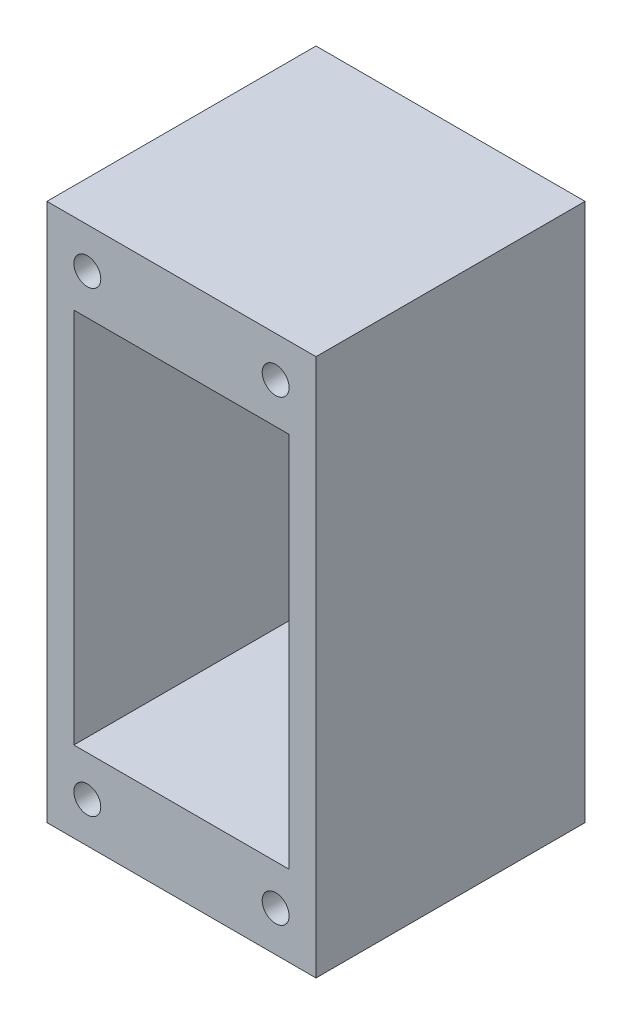
ISO-10303-21;
HEADER;
FILE_DESCRIPTION(('STEP AP214'),'2;1');
FILE_NAME('part.step','',(''),(''),'','','');
FILE_SCHEMA(('AUTOMOTIVE_DESIGN { 1 0 10303 214 1 1 1 1 }'));
ENDSEC;
DATA;
#1=APPLICATION_CONTEXT('core data for automotive mechanical design processes');
#2=APPLICATION_PROTOCOL_DEFINITION('international standard','automotive_design',2000,#1);
#3=PRODUCT_CONTEXT('',#1,'mechanical');
#4=PRODUCT('Part','Part','',(#3));
#5=PRODUCT_RELATED_PRODUCT_CATEGORY('part','',(#4));
#6=PRODUCT_DEFINITION_FORMATION('','',#4);
#7=PRODUCT_DEFINITION_CONTEXT('part definition',#1,'design');
#8=PRODUCT_DEFINITION('design','',#6,#7);
#9=PRODUCT_DEFINITION_SHAPE('','',#8);
#10=(LENGTH_UNIT() NAMED_UNIT(*) SI_UNIT(.MILLI.,.METRE.));
#11=(NAMED_UNIT(*) PLANE_ANGLE_UNIT() SI_UNIT($,.RADIAN.));
#12=(NAMED_UNIT(*) SI_UNIT($,.STERADIAN.) SOLID_ANGLE_UNIT());
#13=UNCERTAINTY_MEASURE_WITH_UNIT(LENGTH_MEASURE(1.E-05),#10,'distance_accuracy_value','');
#14=(GEOMETRIC_REPRESENTATION_CONTEXT(3) GLOBAL_UNCERTAINTY_ASSIGNED_CONTEXT((#13)) GLOBAL_UNIT_ASSIGNED_CONTEXT((#10,
#11,#12)) REPRESENTATION_CONTEXT('',''));
#15=CARTESIAN_POINT('',(0.,0.,0.));
#16=DIRECTION('',(0.,0.,1.));
#17=DIRECTION('',(1.,0.,0.));
#18=AXIS2_PLACEMENT_3D('',#15,#16,#17);
#19=CARTESIAN_POINT('',(0.,0.,50.));
#20=DIRECTION('',(0.,0.,1.));
#21=DIRECTION('',(1.,0.,0.));
#22=AXIS2_PLACEMENT_3D('',#19,#20,#21);
#23=PLANE('',#22);
#24=DIRECTION('',(0.,-1.,0.));
#25=VECTOR('',#24,1.);
#26=CARTESIAN_POINT('',(-20.,-35.,50.));
#27=LINE('',#26,#25);
#28=CARTESIAN_POINT('',(-20.,35.,50.));
#29=VERTEX_POINT('',#28);
#30=CARTESIAN_POINT('',(-20.,-35.,50.));
#31=VERTEX_POINT('',#30);
#32=EDGE_CURVE('E58',#29,#31,#27,.T.);
#33=ORIENTED_EDGE('',*,*,#32,.F.);
#34=DIRECTION('',(-1.,0.,0.));
#35=VECTOR('',#34,1.);
#36=CARTESIAN_POINT('',(-20.,35.,50.));
#37=LINE('',#36,#35);
#38=CARTESIAN_POINT('',(20.,35.,50.));
#39=VERTEX_POINT('',#38);
#40=EDGE_CURVE('E128',#39,#29,#37,.T.);
#41=ORIENTED_EDGE('',*,*,#40,.F.);
#42=DIRECTION('',(0.,1.,0.));
#43=VECTOR('',#42,1.);
#44=CARTESIAN_POINT('',(20.,35.,50.));
#45=LINE('',#44,#43);
#46=CARTESIAN_POINT('',(20.,-35.,50.));
#47=VERTEX_POINT('',#46);
#48=EDGE_CURVE('E111',#47,#39,#45,.T.);
#49=ORIENTED_EDGE('',*,*,#48,.F.);
#50=DIRECTION('',(1.,0.,0.));
#51=VECTOR('',#50,1.);
#52=CARTESIAN_POINT('',(20.,-35.,50.));
#53=LINE('',#52,#51);
#54=EDGE_CURVE('E121',#31,#47,#53,.T.);
#55=ORIENTED_EDGE('',*,*,#54,.F.);
#56=EDGE_LOOP('',(#33,#41,#49,#55));
#57=FACE_BOUND('',#56,.T.);
#58=CARTESIAN_POINT('',(-17.5,-42.5,50.));
#59=DIRECTION('',(0.,0.,1.));
#60=DIRECTION('',(1.,0.,0.));
#61=AXIS2_PLACEMENT_3D('',#58,#59,#60);
#62=CIRCLE('',#61,2.5);
#63=CARTESIAN_POINT('',(-15.,-42.5,50.));
#64=VERTEX_POINT('',#63);
#65=EDGE_CURVE('E151',#64,#64,#62,.T.);
#66=ORIENTED_EDGE('',*,*,#65,.F.);
#67=EDGE_LOOP('',(#66));
#68=FACE_BOUND('',#67,.T.);
#69=CARTESIAN_POINT('',(-17.5,42.5,50.));
#70=DIRECTION('',(0.,0.,1.));
#71=DIRECTION('',(1.,0.,0.));
#72=AXIS2_PLACEMENT_3D('',#69,#70,#71);
#73=CIRCLE('',#72,2.5);
#74=CARTESIAN_POINT('',(-15.,42.5,50.));
#75=VERTEX_POINT('',#74);
#76=EDGE_CURVE('E167',#75,#75,#73,.T.);
#77=ORIENTED_EDGE('',*,*,#76,.F.);
#78=EDGE_LOOP('',(#77));
#79=FACE_BOUND('',#78,.T.);
#80=DIRECTION('',(0.,1.,0.));
#81=VECTOR('',#80,1.);
#82=CARTESIAN_POINT('',(25.,50.,50.));
#83=LINE('',#82,#81);
#84=CARTESIAN_POINT('',(25.,-50.,50.));
#85=VERTEX_POINT('',#84);
#86=CARTESIAN_POINT('',(25.,50.,50.));
#87=VERTEX_POINT('',#86);
#88=EDGE_CURVE('E175',#85,#87,#83,.T.);
#89=ORIENTED_EDGE('',*,*,#88,.T.);
#90=DIRECTION('',(-1.,0.,0.));
#91=VECTOR('',#90,1.);
#92=CARTESIAN_POINT('',(-25.,50.,50.));
#93=LINE('',#92,#91);
#94=CARTESIAN_POINT('',(-25.,50.,50.));
#95=VERTEX_POINT('',#94);
#96=EDGE_CURVE('E179',#87,#95,#93,.T.);
#97=ORIENTED_EDGE('',*,*,#96,.T.);
#98=DIRECTION('',(0.,-1.,0.));
#99=VECTOR('',#98,1.);
#100=CARTESIAN_POINT('',(-25.,50.,50.));
#101=LINE('',#100,#99);
#102=CARTESIAN_POINT('',(-25.,-50.,50.));
#103=VERTEX_POINT('',#102);
#104=EDGE_CURVE('E183',#95,#103,#101,.T.);
#105=ORIENTED_EDGE('',*,*,#104,.T.);
#106=DIRECTION('',(1.,0.,0.));
#107=VECTOR('',#106,1.);
#108=CARTESIAN_POINT('',(-25.,-50.,50.));
#109=LINE('',#108,#107);
#110=EDGE_CURVE('E186',#103,#85,#109,.T.);
#111=ORIENTED_EDGE('',*,*,#110,.T.);
#112=EDGE_LOOP('',(#89,#97,#105,#111));
#113=FACE_BOUND('',#112,.T.);
#114=CARTESIAN_POINT('',(17.5,42.5,50.));
#115=DIRECTION('',(0.,0.,1.));
#116=DIRECTION('',(1.,0.,0.));
#117=AXIS2_PLACEMENT_3D('',#114,#115,#116);
#118=CIRCLE('',#117,2.5);
#119=CARTESIAN_POINT('',(20.,42.5,50.));
#120=VERTEX_POINT('',#119);
#121=EDGE_CURVE('E159',#120,#120,#118,.T.);
#122=ORIENTED_EDGE('',*,*,#121,.F.);
#123=EDGE_LOOP('',(#122));
#124=FACE_BOUND('',#123,.T.);
#125=CARTESIAN_POINT('',(17.5,-42.5,50.));
#126=DIRECTION('',(0.,0.,1.));
#127=DIRECTION('',(1.,0.,0.));
#128=AXIS2_PLACEMENT_3D('',#125,#126,#127);
#129=CIRCLE('',#128,2.5);
#130=CARTESIAN_POINT('',(20.,-42.5,50.));
#131=VERTEX_POINT('',#130);
#132=EDGE_CURVE('E143',#131,#131,#129,.T.);
#133=ORIENTED_EDGE('',*,*,#132,.F.);
#134=EDGE_LOOP('',(#133));
#135=FACE_BOUND('',#134,.T.);
#136=ADVANCED_FACE('F42',(#57,#68,#79,#113,#124,#135),#23,.T.);
#137=CARTESIAN_POINT('',(0.,0.,0.));
#138=DIRECTION('',(0.,0.,1.));
#139=DIRECTION('',(1.,0.,0.));
#140=AXIS2_PLACEMENT_3D('',#137,#138,#139);
#141=PLANE('',#140);
#142=DIRECTION('',(-1.,0.,0.));
#143=VECTOR('',#142,1.);
#144=CARTESIAN_POINT('',(0.,35.,0.));
#145=LINE('',#144,#143);
#146=CARTESIAN_POINT('',(20.,35.,0.));
#147=VERTEX_POINT('',#146);
#148=CARTESIAN_POINT('',(-20.,35.,0.));
#149=VERTEX_POINT('',#148);
#150=EDGE_CURVE('E51',#147,#149,#145,.T.);
#151=ORIENTED_EDGE('',*,*,#150,.T.);
#152=DIRECTION('',(0.,-1.,0.));
#153=VECTOR('',#152,1.);
#154=CARTESIAN_POINT('',(-20.,0.,0.));
#155=LINE('',#154,#153);
#156=CARTESIAN_POINT('',(-20.,-35.,0.));
#157=VERTEX_POINT('',#156);
#158=EDGE_CURVE('E11',#149,#157,#155,.T.);
#159=ORIENTED_EDGE('',*,*,#158,.T.);
#160=DIRECTION('',(1.,0.,0.));
#161=VECTOR('',#160,1.);
#162=CARTESIAN_POINT('',(0.,-35.,0.));
#163=LINE('',#162,#161);
#164=CARTESIAN_POINT('',(20.,-35.,0.));
#165=VERTEX_POINT('',#164);
#166=EDGE_CURVE('E216',#157,#165,#163,.T.);
#167=ORIENTED_EDGE('',*,*,#166,.T.);
#168=DIRECTION('',(0.,1.,0.));
#169=VECTOR('',#168,1.);
#170=CARTESIAN_POINT('',(20.,0.,0.));
#171=LINE('',#170,#169);
#172=EDGE_CURVE('E114',#165,#147,#171,.T.);
#173=ORIENTED_EDGE('',*,*,#172,.T.);
#174=EDGE_LOOP('',(#151,#159,#167,#173));
#175=FACE_BOUND('',#174,.T.);
#176=DIRECTION('',(0.,1.,0.));
#177=VECTOR('',#176,1.);
#178=CARTESIAN_POINT('',(25.,50.,0.));
#179=LINE('',#178,#177);
#180=CARTESIAN_POINT('',(25.,-50.,0.));
#181=VERTEX_POINT('',#180);
#182=CARTESIAN_POINT('',(25.,50.,0.));
#183=VERTEX_POINT('',#182);
#184=EDGE_CURVE('E171',#181,#183,#179,.T.);
#185=ORIENTED_EDGE('',*,*,#184,.F.);
#186=DIRECTION('',(1.,0.,0.));
#187=VECTOR('',#186,1.);
#188=CARTESIAN_POINT('',(-25.,-50.,0.));
#189=LINE('',#188,#187);
#190=CARTESIAN_POINT('',(-25.,-50.,0.));
#191=VERTEX_POINT('',#190);
#192=EDGE_CURVE('E180',#191,#181,#189,.T.);
#193=ORIENTED_EDGE('',*,*,#192,.F.);
#194=DIRECTION('',(0.,-1.,0.));
#195=VECTOR('',#194,1.);
#196=CARTESIAN_POINT('',(-25.,50.,0.));
#197=LINE('',#196,#195);
#198=CARTESIAN_POINT('',(-25.,50.,0.));
#199=VERTEX_POINT('',#198);
#200=EDGE_CURVE('E196',#199,#191,#197,.T.);
#201=ORIENTED_EDGE('',*,*,#200,.F.);
#202=DIRECTION('',(-1.,0.,0.));
#203=VECTOR('',#202,1.);
#204=CARTESIAN_POINT('',(-25.,50.,0.));
#205=LINE('',#204,#203);
#206=EDGE_CURVE('E193',#183,#199,#205,.T.);
#207=ORIENTED_EDGE('',*,*,#206,.F.);
#208=EDGE_LOOP('',(#185,#193,#201,#207));
#209=FACE_BOUND('',#208,.T.);
#210=CARTESIAN_POINT('',(-17.5,42.5,0.));
#211=DIRECTION('',(0.,0.,1.));
#212=DIRECTION('',(1.,0.,0.));
#213=AXIS2_PLACEMENT_3D('',#210,#211,#212);
#214=CIRCLE('',#213,2.5);
#215=CARTESIAN_POINT('',(-15.,42.5,0.));
#216=VERTEX_POINT('',#215);
#217=EDGE_CURVE('E163',#216,#216,#214,.T.);
#218=ORIENTED_EDGE('',*,*,#217,.T.);
#219=EDGE_LOOP('',(#218));
#220=FACE_BOUND('',#219,.T.);
#221=CARTESIAN_POINT('',(17.5,42.5,0.));
#222=DIRECTION('',(0.,0.,1.));
#223=DIRECTION('',(1.,0.,0.));
#224=AXIS2_PLACEMENT_3D('',#221,#222,#223);
#225=CIRCLE('',#224,2.5);
#226=CARTESIAN_POINT('',(20.,42.5,0.));
#227=VERTEX_POINT('',#226);
#228=EDGE_CURVE('E155',#227,#227,#225,.T.);
#229=ORIENTED_EDGE('',*,*,#228,.T.);
#230=EDGE_LOOP('',(#229));
#231=FACE_BOUND('',#230,.T.);
#232=CARTESIAN_POINT('',(-17.5,-42.5,0.));
#233=DIRECTION('',(0.,0.,1.));
#234=DIRECTION('',(1.,0.,0.));
#235=AXIS2_PLACEMENT_3D('',#232,#233,#234);
#236=CIRCLE('',#235,2.5);
#237=CARTESIAN_POINT('',(-15.,-42.5,0.));
#238=VERTEX_POINT('',#237);
#239=EDGE_CURVE('E147',#238,#238,#236,.T.);
#240=ORIENTED_EDGE('',*,*,#239,.T.);
#241=EDGE_LOOP('',(#240));
#242=FACE_BOUND('',#241,.T.);
#243=CARTESIAN_POINT('',(17.5,-42.5,0.));
#244=DIRECTION('',(0.,0.,1.));
#245=DIRECTION('',(1.,0.,0.));
#246=AXIS2_PLACEMENT_3D('',#243,#244,#245);
#247=CIRCLE('',#246,2.5);
#248=CARTESIAN_POINT('',(20.,-42.5,0.));
#249=VERTEX_POINT('',#248);
#250=EDGE_CURVE('E138',#249,#249,#247,.T.);
#251=ORIENTED_EDGE('',*,*,#250,.T.);
#252=EDGE_LOOP('',(#251));
#253=FACE_BOUND('',#252,.T.);
#254=ADVANCED_FACE('F223',(#175,#209,#220,#231,#242,#253),#141,.F.);
#255=CARTESIAN_POINT('',(25.,50.,50.));
#256=DIRECTION('',(-1.,0.,0.));
#257=DIRECTION('',(0.,-1.,0.));
#258=AXIS2_PLACEMENT_3D('',#255,#256,#257);
#259=PLANE('',#258);
#260=ORIENTED_EDGE('',*,*,#184,.T.);
#261=DIRECTION('',(0.,0.,-1.));
#262=VECTOR('',#261,1.);
#263=CARTESIAN_POINT('',(25.,50.,50.));
#264=LINE('',#263,#262);
#265=EDGE_CURVE('E212',#87,#183,#264,.T.);
#266=ORIENTED_EDGE('',*,*,#265,.F.);
#267=ORIENTED_EDGE('',*,*,#88,.F.);
#268=DIRECTION('',(0.,0.,-1.));
#269=VECTOR('',#268,1.);
#270=CARTESIAN_POINT('',(25.,-50.,50.));
#271=LINE('',#270,#269);
#272=EDGE_CURVE('E189',#85,#181,#271,.T.);
#273=ORIENTED_EDGE('',*,*,#272,.T.);
#274=EDGE_LOOP('',(#260,#266,#267,#273));
#275=FACE_BOUND('',#274,.T.);
#276=ADVANCED_FACE('F44',(#275),#259,.F.);
#277=CARTESIAN_POINT('',(-25.,50.,50.));
#278=DIRECTION('',(0.,-1.,0.));
#279=DIRECTION('',(0.,0.,-1.));
#280=AXIS2_PLACEMENT_3D('',#277,#278,#279);
#281=PLANE('',#280);
#282=ORIENTED_EDGE('',*,*,#206,.T.);
#283=DIRECTION('',(0.,0.,-1.));
#284=VECTOR('',#283,1.);
#285=CARTESIAN_POINT('',(-25.,50.,50.));
#286=LINE('',#285,#284);
#287=EDGE_CURVE('E208',#95,#199,#286,.T.);
#288=ORIENTED_EDGE('',*,*,#287,.F.);
#289=ORIENTED_EDGE('',*,*,#96,.F.);
#290=ORIENTED_EDGE('',*,*,#265,.T.);
#291=EDGE_LOOP('',(#282,#288,#289,#290));
#292=FACE_BOUND('',#291,.T.);
#293=ADVANCED_FACE('F258',(#292),#281,.F.);
#294=CARTESIAN_POINT('',(-25.,50.,50.));
#295=DIRECTION('',(1.,0.,0.));
#296=DIRECTION('',(0.,1.,0.));
#297=AXIS2_PLACEMENT_3D('',#294,#295,#296);
#298=PLANE('',#297);
#299=ORIENTED_EDGE('',*,*,#200,.T.);
#300=DIRECTION('',(0.,0.,-1.));
#301=VECTOR('',#300,1.);
#302=CARTESIAN_POINT('',(-25.,-50.,50.));
#303=LINE('',#302,#301);
#304=EDGE_CURVE('E204',#103,#191,#303,.T.);
#305=ORIENTED_EDGE('',*,*,#304,.F.);
#306=ORIENTED_EDGE('',*,*,#104,.F.);
#307=ORIENTED_EDGE('',*,*,#287,.T.);
#308=EDGE_LOOP('',(#299,#305,#306,#307));
#309=FACE_BOUND('',#308,.T.);
#310=ADVANCED_FACE('F255',(#309),#298,.F.);
#311=CARTESIAN_POINT('',(-25.,-50.,50.));
#312=DIRECTION('',(0.,1.,0.));
#313=DIRECTION('',(0.,0.,1.));
#314=AXIS2_PLACEMENT_3D('',#311,#312,#313);
#315=PLANE('',#314);
#316=ORIENTED_EDGE('',*,*,#192,.T.);
#317=ORIENTED_EDGE('',*,*,#272,.F.);
#318=ORIENTED_EDGE('',*,*,#110,.F.);
#319=ORIENTED_EDGE('',*,*,#304,.T.);
#320=EDGE_LOOP('',(#316,#317,#318,#319));
#321=FACE_BOUND('',#320,.T.);
#322=ADVANCED_FACE('F252',(#321),#315,.F.);
#323=CARTESIAN_POINT('',(-17.5,42.5,50.));
#324=DIRECTION('',(0.,0.,-1.));
#325=DIRECTION('',(-1.,0.,0.));
#326=AXIS2_PLACEMENT_3D('',#323,#324,#325);
#327=CYLINDRICAL_SURFACE('',#326,2.5);
#328=ORIENTED_EDGE('',*,*,#76,.T.);
#329=EDGE_LOOP('',(#328));
#330=FACE_BOUND('',#329,.T.);
#331=ORIENTED_EDGE('',*,*,#217,.F.);
#332=EDGE_LOOP('',(#331));
#333=FACE_BOUND('',#332,.T.);
#334=ADVANCED_FACE('F249',(#330,#333),#327,.F.);
#335=CARTESIAN_POINT('',(17.5,42.5,50.));
#336=DIRECTION('',(0.,0.,-1.));
#337=DIRECTION('',(-1.,0.,0.));
#338=AXIS2_PLACEMENT_3D('',#335,#336,#337);
#339=CYLINDRICAL_SURFACE('',#338,2.5);
#340=ORIENTED_EDGE('',*,*,#121,.T.);
#341=EDGE_LOOP('',(#340));
#342=FACE_BOUND('',#341,.T.);
#343=ORIENTED_EDGE('',*,*,#228,.F.);
#344=EDGE_LOOP('',(#343));
#345=FACE_BOUND('',#344,.T.);
#346=ADVANCED_FACE('F286',(#342,#345),#339,.F.);
#347=CARTESIAN_POINT('',(-17.5,-42.5,50.));
#348=DIRECTION('',(0.,0.,-1.));
#349=DIRECTION('',(-1.,0.,0.));
#350=AXIS2_PLACEMENT_3D('',#347,#348,#349);
#351=CYLINDRICAL_SURFACE('',#350,2.5);
#352=ORIENTED_EDGE('',*,*,#65,.T.);
#353=EDGE_LOOP('',(#352));
#354=FACE_BOUND('',#353,.T.);
#355=ORIENTED_EDGE('',*,*,#239,.F.);
#356=EDGE_LOOP('',(#355));
#357=FACE_BOUND('',#356,.T.);
#358=ADVANCED_FACE('F237',(#354,#357),#351,.F.);
#359=CARTESIAN_POINT('',(17.5,-42.5,50.));
#360=DIRECTION('',(0.,0.,-1.));
#361=DIRECTION('',(-1.,0.,0.));
#362=AXIS2_PLACEMENT_3D('',#359,#360,#361);
#363=CYLINDRICAL_SURFACE('',#362,2.5);
#364=ORIENTED_EDGE('',*,*,#132,.T.);
#365=EDGE_LOOP('',(#364));
#366=FACE_BOUND('',#365,.T.);
#367=ORIENTED_EDGE('',*,*,#250,.F.);
#368=EDGE_LOOP('',(#367));
#369=FACE_BOUND('',#368,.T.);
#370=ADVANCED_FACE('F230',(#366,#369),#363,.F.);
#371=CARTESIAN_POINT('',(-20.,-35.,-43.));
#372=DIRECTION('',(-1.,0.,0.));
#373=DIRECTION('',(0.,-1.,0.));
#374=AXIS2_PLACEMENT_3D('',#371,#372,#373);
#375=PLANE('',#374);
#376=DIRECTION('',(0.,0.,1.));
#377=VECTOR('',#376,1.);
#378=CARTESIAN_POINT('',(-20.,35.,-43.));
#379=LINE('',#378,#377);
#380=EDGE_CURVE('E135',#149,#29,#379,.T.);
#381=ORIENTED_EDGE('',*,*,#380,.T.);
#382=ORIENTED_EDGE('',*,*,#32,.T.);
#383=DIRECTION('',(0.,0.,1.));
#384=VECTOR('',#383,1.);
#385=CARTESIAN_POINT('',(-20.,-35.,-43.));
#386=LINE('',#385,#384);
#387=EDGE_CURVE('E118',#157,#31,#386,.T.);
#388=ORIENTED_EDGE('',*,*,#387,.F.);
#389=ORIENTED_EDGE('',*,*,#158,.F.);
#390=EDGE_LOOP('',(#381,#382,#388,#389));
#391=FACE_BOUND('',#390,.T.);
#392=ADVANCED_FACE('F228',(#391),#375,.F.);
#393=CARTESIAN_POINT('',(-20.,35.,-43.));
#394=DIRECTION('',(0.,1.,0.));
#395=DIRECTION('',(0.,0.,1.));
#396=AXIS2_PLACEMENT_3D('',#393,#394,#395);
#397=PLANE('',#396);
#398=DIRECTION('',(0.,0.,1.));
#399=VECTOR('',#398,1.);
#400=CARTESIAN_POINT('',(20.,35.,-43.));
#401=LINE('',#400,#399);
#402=EDGE_CURVE('E117',#147,#39,#401,.T.);
#403=ORIENTED_EDGE('',*,*,#402,.T.);
#404=ORIENTED_EDGE('',*,*,#40,.T.);
#405=ORIENTED_EDGE('',*,*,#380,.F.);
#406=ORIENTED_EDGE('',*,*,#150,.F.);
#407=EDGE_LOOP('',(#403,#404,#405,#406));
#408=FACE_BOUND('',#407,.T.);
#409=ADVANCED_FACE('F227',(#408),#397,.F.);
#410=CARTESIAN_POINT('',(20.,35.,-43.));
#411=DIRECTION('',(1.,0.,0.));
#412=DIRECTION('',(0.,1.,0.));
#413=AXIS2_PLACEMENT_3D('',#410,#411,#412);
#414=PLANE('',#413);
#415=DIRECTION('',(0.,0.,1.));
#416=VECTOR('',#415,1.);
#417=CARTESIAN_POINT('',(20.,-35.,-43.));
#418=LINE('',#417,#416);
#419=EDGE_CURVE('E66',#165,#47,#418,.T.);
#420=ORIENTED_EDGE('',*,*,#419,.T.);
#421=ORIENTED_EDGE('',*,*,#48,.T.);
#422=ORIENTED_EDGE('',*,*,#402,.F.);
#423=ORIENTED_EDGE('',*,*,#172,.F.);
#424=EDGE_LOOP('',(#420,#421,#422,#423));
#425=FACE_BOUND('',#424,.T.);
#426=ADVANCED_FACE('F108',(#425),#414,.F.);
#427=CARTESIAN_POINT('',(20.,-35.,-43.));
#428=DIRECTION('',(0.,-1.,0.));
#429=DIRECTION('',(1.,0.,0.));
#430=AXIS2_PLACEMENT_3D('',#427,#428,#429);
#431=PLANE('',#430);
#432=ORIENTED_EDGE('',*,*,#387,.T.);
#433=ORIENTED_EDGE('',*,*,#54,.T.);
#434=ORIENTED_EDGE('',*,*,#419,.F.);
#435=ORIENTED_EDGE('',*,*,#166,.F.);
#436=EDGE_LOOP('',(#432,#433,#434,#435));
#437=FACE_BOUND('',#436,.T.);
#438=ADVANCED_FACE('F122',(#437),#431,.F.);
#439=CLOSED_SHELL('',(#136,#254,#276,#293,#310,#322,#334,#346,#358,#370,#392,#409,#426,#438));
#440=MANIFOLD_SOLID_BREP('B2',#439);
#441=ADVANCED_BREP_SHAPE_REPRESENTATION('',(#18,#440),#14);
#442=SHAPE_DEFINITION_REPRESENTATION(#9,#441);
ENDSEC;
END-ISO-10303-21;
